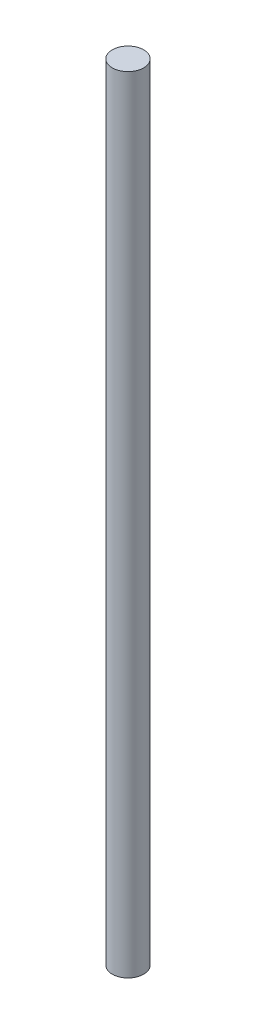
ISO-10303-21;
HEADER;
FILE_DESCRIPTION(('STEP AP214'),'2;1');
FILE_NAME('part.step','',(''),(''),'','','');
FILE_SCHEMA(('AUTOMOTIVE_DESIGN { 1 0 10303 214 1 1 1 1 }'));
ENDSEC;
DATA;
#1=APPLICATION_CONTEXT('core data for automotive mechanical design processes');
#2=APPLICATION_PROTOCOL_DEFINITION('international standard','automotive_design',2000,#1);
#3=PRODUCT_CONTEXT('',#1,'mechanical');
#4=PRODUCT('Part','Part','',(#3));
#5=PRODUCT_RELATED_PRODUCT_CATEGORY('part','',(#4));
#6=PRODUCT_DEFINITION_FORMATION('','',#4);
#7=PRODUCT_DEFINITION_CONTEXT('part definition',#1,'design');
#8=PRODUCT_DEFINITION('design','',#6,#7);
#9=PRODUCT_DEFINITION_SHAPE('','',#8);
#10=(LENGTH_UNIT() NAMED_UNIT(*) SI_UNIT(.MILLI.,.METRE.));
#11=(NAMED_UNIT(*) PLANE_ANGLE_UNIT() SI_UNIT($,.RADIAN.));
#12=(NAMED_UNIT(*) SI_UNIT($,.STERADIAN.) SOLID_ANGLE_UNIT());
#13=UNCERTAINTY_MEASURE_WITH_UNIT(LENGTH_MEASURE(1.E-05),#10,'distance_accuracy_value','');
#14=(GEOMETRIC_REPRESENTATION_CONTEXT(3) GLOBAL_UNCERTAINTY_ASSIGNED_CONTEXT((#13)) GLOBAL_UNIT_ASSIGNED_CONTEXT((#10,
#11,#12)) REPRESENTATION_CONTEXT('',''));
#15=CARTESIAN_POINT('',(0.,0.,0.));
#16=DIRECTION('',(0.,0.,1.));
#17=DIRECTION('',(1.,0.,0.));
#18=AXIS2_PLACEMENT_3D('',#15,#16,#17);
#19=CARTESIAN_POINT('',(0.,250.,0.));
#20=DIRECTION('',(0.,-1.,0.));
#21=DIRECTION('',(0.,0.,-1.));
#22=AXIS2_PLACEMENT_3D('',#19,#20,#21);
#23=CYLINDRICAL_SURFACE('',#22,5.);
#24=CARTESIAN_POINT('',(0.,250.,0.));
#25=DIRECTION('',(0.,1.,0.));
#26=DIRECTION('',(0.,0.,1.));
#27=AXIS2_PLACEMENT_3D('',#24,#25,#26);
#28=CIRCLE('',#27,5.);
#29=CARTESIAN_POINT('',(0.,250.,5.));
#30=VERTEX_POINT('',#29);
#31=EDGE_CURVE('E10',#30,#30,#28,.T.);
#32=ORIENTED_EDGE('',*,*,#31,.F.);
#33=EDGE_LOOP('',(#32));
#34=FACE_BOUND('',#33,.T.);
#35=CARTESIAN_POINT('',(0.,0.,0.));
#36=DIRECTION('',(0.,1.,0.));
#37=DIRECTION('',(0.,0.,1.));
#38=AXIS2_PLACEMENT_3D('',#35,#36,#37);
#39=CIRCLE('',#38,5.);
#40=CARTESIAN_POINT('',(0.,0.,5.));
#41=VERTEX_POINT('',#40);
#42=EDGE_CURVE('E34',#41,#41,#39,.T.);
#43=ORIENTED_EDGE('',*,*,#42,.T.);
#44=EDGE_LOOP('',(#43));
#45=FACE_BOUND('',#44,.T.);
#46=ADVANCED_FACE('F31',(#34,#45),#23,.T.);
#47=CARTESIAN_POINT('',(0.,250.,0.));
#48=DIRECTION('',(0.,1.,0.));
#49=DIRECTION('',(0.,0.,1.));
#50=AXIS2_PLACEMENT_3D('',#47,#48,#49);
#51=PLANE('',#50);
#52=ORIENTED_EDGE('',*,*,#31,.T.);
#53=EDGE_LOOP('',(#52));
#54=FACE_BOUND('',#53,.T.);
#55=ADVANCED_FACE('F46',(#54),#51,.T.);
#56=CARTESIAN_POINT('',(0.,0.,0.));
#57=DIRECTION('',(0.,1.,0.));
#58=DIRECTION('',(0.,0.,1.));
#59=AXIS2_PLACEMENT_3D('',#56,#57,#58);
#60=PLANE('',#59);
#61=ORIENTED_EDGE('',*,*,#42,.F.);
#62=EDGE_LOOP('',(#61));
#63=FACE_BOUND('',#62,.T.);
#64=ADVANCED_FACE('F44',(#63),#60,.F.);
#65=CLOSED_SHELL('',(#46,#55,#64));
#66=MANIFOLD_SOLID_BREP('B2',#65);
#67=ADVANCED_BREP_SHAPE_REPRESENTATION('',(#18,#66),#14);
#68=SHAPE_DEFINITION_REPRESENTATION(#9,#67);
ENDSEC;
END-ISO-10303-21;
